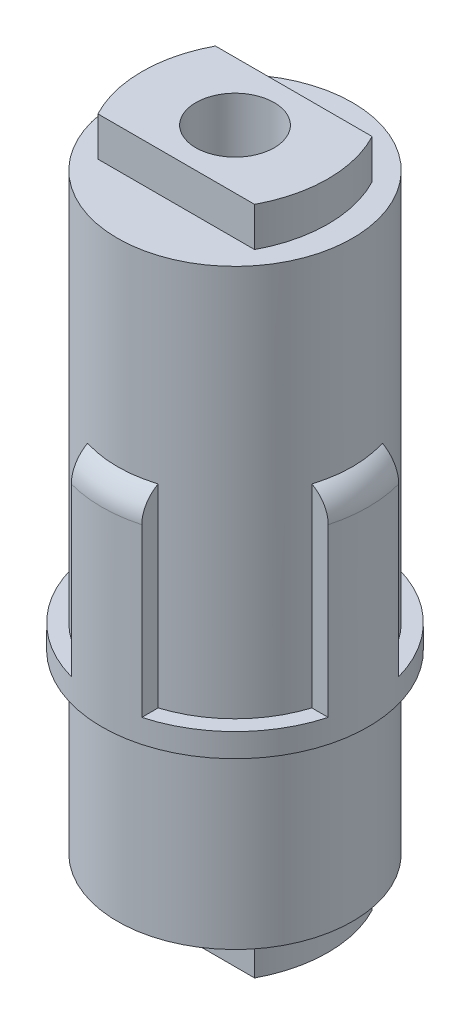
ISO-10303-21;
HEADER;
FILE_DESCRIPTION(('STEP AP214'),'2;1');
FILE_NAME('part.step','',(''),(''),'','','');
FILE_SCHEMA(('AUTOMOTIVE_DESIGN { 1 0 10303 214 1 1 1 1 }'));
ENDSEC;
DATA;
#1=APPLICATION_CONTEXT('core data for automotive mechanical design processes');
#2=APPLICATION_PROTOCOL_DEFINITION('international standard','automotive_design',2000,#1);
#3=PRODUCT_CONTEXT('',#1,'mechanical');
#4=PRODUCT('Part','Part','',(#3));
#5=PRODUCT_RELATED_PRODUCT_CATEGORY('part','',(#4));
#6=PRODUCT_DEFINITION_FORMATION('','',#4);
#7=PRODUCT_DEFINITION_CONTEXT('part definition',#1,'design');
#8=PRODUCT_DEFINITION('design','',#6,#7);
#9=PRODUCT_DEFINITION_SHAPE('','',#8);
#10=(LENGTH_UNIT() NAMED_UNIT(*) SI_UNIT(.MILLI.,.METRE.));
#11=(NAMED_UNIT(*) PLANE_ANGLE_UNIT() SI_UNIT($,.RADIAN.));
#12=(NAMED_UNIT(*) SI_UNIT($,.STERADIAN.) SOLID_ANGLE_UNIT());
#13=UNCERTAINTY_MEASURE_WITH_UNIT(LENGTH_MEASURE(1.E-05),#10,'distance_accuracy_value','');
#14=(GEOMETRIC_REPRESENTATION_CONTEXT(3) GLOBAL_UNCERTAINTY_ASSIGNED_CONTEXT((#13)) GLOBAL_UNIT_ASSIGNED_CONTEXT((#10,
#11,#12)) REPRESENTATION_CONTEXT('',''));
#15=CARTESIAN_POINT('',(0.,0.,0.));
#16=DIRECTION('',(0.,0.,1.));
#17=DIRECTION('',(1.,0.,0.));
#18=AXIS2_PLACEMENT_3D('',#15,#16,#17);
#19=CARTESIAN_POINT('',(0.,0.,0.));
#20=DIRECTION('',(0.,-1.,0.));
#21=DIRECTION('',(0.,0.,-1.));
#22=AXIS2_PLACEMENT_3D('',#19,#20,#21);
#23=PLANE('',#22);
#24=CARTESIAN_POINT('',(0.,0.,0.));
#25=DIRECTION('',(0.,1.,0.));
#26=DIRECTION('',(0.,0.,1.));
#27=AXIS2_PLACEMENT_3D('',#24,#25,#26);
#28=CIRCLE('',#27,7.5);
#29=CARTESIAN_POINT('',(-2.25,0.,-7.15454401062709));
#30=VERTEX_POINT('',#29);
#31=CARTESIAN_POINT('',(-7.15454401062709,0.,-2.25));
#32=VERTEX_POINT('',#31);
#33=EDGE_CURVE('E511',#30,#32,#28,.T.);
#34=ORIENTED_EDGE('',*,*,#33,.F.);
#35=DIRECTION('',(0.,0.,1.));
#36=VECTOR('',#35,1.);
#37=CARTESIAN_POINT('',(-2.25,0.,-8.1967981553775));
#38=LINE('',#37,#36);
#39=CARTESIAN_POINT('',(-2.25,0.,-8.1967981553775));
#40=VERTEX_POINT('',#39);
#41=EDGE_CURVE('E389',#40,#30,#38,.T.);
#42=ORIENTED_EDGE('',*,*,#41,.F.);
#43=CARTESIAN_POINT('',(0.,0.,0.));
#44=DIRECTION('',(0.,-1.,0.));
#45=DIRECTION('',(0.,0.,-1.));
#46=AXIS2_PLACEMENT_3D('',#43,#44,#45);
#47=CIRCLE('',#46,8.5);
#48=CARTESIAN_POINT('',(-8.1967981553775,0.,-2.25));
#49=VERTEX_POINT('',#48);
#50=EDGE_CURVE('E403',#49,#40,#47,.T.);
#51=ORIENTED_EDGE('',*,*,#50,.F.);
#52=DIRECTION('',(-1.,0.,0.));
#53=VECTOR('',#52,1.);
#54=CARTESIAN_POINT('',(-6.89202437604511,0.,-2.25));
#55=LINE('',#54,#53);
#56=EDGE_CURVE('E344',#32,#49,#55,.T.);
#57=ORIENTED_EDGE('',*,*,#56,.F.);
#58=EDGE_LOOP('',(#34,#42,#51,#57));
#59=FACE_BOUND('',#58,.T.);
#60=ADVANCED_FACE('F56',(#59),#23,.F.);
#61=CARTESIAN_POINT('',(-7.15454401062709,0.,2.25));
#62=VERTEX_POINT('',#61);
#63=CARTESIAN_POINT('',(-2.25,0.,7.15454401062709));
#64=VERTEX_POINT('',#63);
#65=EDGE_CURVE('E294',#62,#64,#28,.T.);
#66=ORIENTED_EDGE('',*,*,#65,.F.);
#67=DIRECTION('',(1.,0.,0.));
#68=VECTOR('',#67,1.);
#69=CARTESIAN_POINT('',(-6.89202437604511,0.,2.25));
#70=LINE('',#69,#68);
#71=CARTESIAN_POINT('',(-8.1967981553775,0.,2.25));
#72=VERTEX_POINT('',#71);
#73=EDGE_CURVE('E350',#72,#62,#70,.T.);
#74=ORIENTED_EDGE('',*,*,#73,.F.);
#75=CARTESIAN_POINT('',(-2.25,0.,8.1967981553775));
#76=VERTEX_POINT('',#75);
#77=EDGE_CURVE('E524',#76,#72,#47,.T.);
#78=ORIENTED_EDGE('',*,*,#77,.F.);
#79=DIRECTION('',(0.,0.,1.));
#80=VECTOR('',#79,1.);
#81=CARTESIAN_POINT('',(-2.25,0.,8.1967981553775));
#82=LINE('',#81,#80);
#83=EDGE_CURVE('E365',#64,#76,#82,.T.);
#84=ORIENTED_EDGE('',*,*,#83,.F.);
#85=EDGE_LOOP('',(#66,#74,#78,#84));
#86=FACE_BOUND('',#85,.T.);
#87=ADVANCED_FACE('F489',(#86),#23,.F.);
#88=CARTESIAN_POINT('',(2.25,0.,7.15454401062709));
#89=VERTEX_POINT('',#88);
#90=CARTESIAN_POINT('',(7.15454401062709,0.,2.25));
#91=VERTEX_POINT('',#90);
#92=EDGE_CURVE('E300',#89,#91,#28,.T.);
#93=ORIENTED_EDGE('',*,*,#92,.F.);
#94=DIRECTION('',(0.,0.,-1.));
#95=VECTOR('',#94,1.);
#96=CARTESIAN_POINT('',(2.25,0.,8.1967981553775));
#97=LINE('',#96,#95);
#98=CARTESIAN_POINT('',(2.25,0.,8.1967981553775));
#99=VERTEX_POINT('',#98);
#100=EDGE_CURVE('E361',#99,#89,#97,.T.);
#101=ORIENTED_EDGE('',*,*,#100,.F.);
#102=CARTESIAN_POINT('',(8.1967981553775,0.,2.25));
#103=VERTEX_POINT('',#102);
#104=EDGE_CURVE('E413',#103,#99,#47,.T.);
#105=ORIENTED_EDGE('',*,*,#104,.F.);
#106=DIRECTION('',(1.,0.,0.));
#107=VECTOR('',#106,1.);
#108=CARTESIAN_POINT('',(6.89202437604511,0.,2.25));
#109=LINE('',#108,#107);
#110=EDGE_CURVE('E375',#91,#103,#109,.T.);
#111=ORIENTED_EDGE('',*,*,#110,.F.);
#112=EDGE_LOOP('',(#93,#101,#105,#111));
#113=FACE_BOUND('',#112,.T.);
#114=ADVANCED_FACE('F539',(#113),#23,.F.);
#115=CARTESIAN_POINT('',(7.15454401062709,0.,-2.25));
#116=VERTEX_POINT('',#115);
#117=CARTESIAN_POINT('',(2.25,0.,-7.15454401062709));
#118=VERTEX_POINT('',#117);
#119=EDGE_CURVE('E303',#116,#118,#28,.T.);
#120=ORIENTED_EDGE('',*,*,#119,.F.);
#121=DIRECTION('',(-1.,0.,0.));
#122=VECTOR('',#121,1.);
#123=CARTESIAN_POINT('',(6.89202437604511,0.,-2.25));
#124=LINE('',#123,#122);
#125=CARTESIAN_POINT('',(8.19679815537751,0.,-2.25));
#126=VERTEX_POINT('',#125);
#127=EDGE_CURVE('E378',#126,#116,#124,.T.);
#128=ORIENTED_EDGE('',*,*,#127,.F.);
#129=CARTESIAN_POINT('',(2.25,0.,-8.1967981553775));
#130=VERTEX_POINT('',#129);
#131=EDGE_CURVE('E409',#130,#126,#47,.T.);
#132=ORIENTED_EDGE('',*,*,#131,.F.);
#133=DIRECTION('',(0.,0.,-1.));
#134=VECTOR('',#133,1.);
#135=CARTESIAN_POINT('',(2.25,0.,-8.1967981553775));
#136=LINE('',#135,#134);
#137=EDGE_CURVE('E393',#118,#130,#136,.T.);
#138=ORIENTED_EDGE('',*,*,#137,.F.);
#139=EDGE_LOOP('',(#120,#128,#132,#138));
#140=FACE_BOUND('',#139,.T.);
#141=ADVANCED_FACE('F478',(#140),#23,.F.);
#142=CARTESIAN_POINT('',(-2.25,12.5,-8.1967981553775));
#143=DIRECTION('',(1.,0.,0.));
#144=DIRECTION('',(0.,0.,-1.));
#145=AXIS2_PLACEMENT_3D('',#142,#143,#144);
#146=PLANE('',#145);
#147=DIRECTION('',(0.,-1.,0.));
#148=VECTOR('',#147,1.);
#149=CARTESIAN_POINT('',(-2.25,46.2132034355964,-7.15454401062709));
#150=LINE('',#149,#148);
#151=CARTESIAN_POINT('',(-2.25,12.378001185795,-7.15454401062709));
#152=VERTEX_POINT('',#151);
#153=EDGE_CURVE('E326',#152,#30,#150,.T.);
#154=ORIENTED_EDGE('',*,*,#153,.F.);
#155=CARTESIAN_POINT('',(-2.25,12.5,-6.89202437604511));
#156=CARTESIAN_POINT('',(-2.25,12.4791061311628,-6.94635625669846));
#157=CARTESIAN_POINT('',(-2.25,12.4560116676686,-6.99981697123115));
#158=CARTESIAN_POINT('',(-2.25,12.4055046719596,-7.10466973408814));
#159=CARTESIAN_POINT('',(-2.25,12.378091315717,-7.15606138528908));
#160=CARTESIAN_POINT('',(-2.25,12.2895078386146,-7.30661751819547));
#161=CARTESIAN_POINT('',(-2.25,12.2219964937387,-7.40215747638858));
#162=CARTESIAN_POINT('',(-2.25,12.0716064925068,-7.58046919260013));
#163=CARTESIAN_POINT('',(-2.25,11.9887042709286,-7.66322100958712));
#164=CARTESIAN_POINT('',(-2.25,11.8097967927969,-7.81302642080061));
#165=CARTESIAN_POINT('',(-2.25,11.7138002298588,-7.88009035101607));
#166=CARTESIAN_POINT('',(-2.25,11.5146930106107,-7.99436140488065));
#167=CARTESIAN_POINT('',(-2.25,11.4119040266993,-8.04213023044214));
#168=CARTESIAN_POINT('',(-2.25,11.1996187287232,-8.1191212713278));
#169=CARTESIAN_POINT('',(-2.25,11.0901282147757,-8.14835928281573));
#170=CARTESIAN_POINT('',(-2.25,10.9240165273401,-8.17747277452936));
#171=CARTESIAN_POINT('',(-2.25,10.8685967677682,-8.18471996991647));
#172=CARTESIAN_POINT('',(-2.25,10.7574438963181,-8.19437813078189));
#173=CARTESIAN_POINT('',(-2.25,10.7017115830306,-8.19679828788171));
#174=CARTESIAN_POINT('',(-2.25,10.6459503782261,-8.1967981553775));
#175=B_SPLINE_CURVE_WITH_KNOTS('',3,(#155,#156,#157,#158,#159,#160,#161,#162,#163,#164,#165,
#166,#167,#168,#169,#170,#171,#172,#173,#174),.UNSPECIFIED.,.F.,.F.,(4,2,2,2,2,2,2,2,2,4),(0.,
0.174535420831491,0.349104182759231,0.698259802026039,1.04795449536431,1.39741813877047,
1.73581200221471,2.07391702029522,2.24141024833911,2.40858423097572),.UNSPECIFIED.);
#176=CARTESIAN_POINT('',(-2.25,10.6459503782261,-8.1967981553775));
#177=VERTEX_POINT('',#176);
#178=EDGE_CURVE('E454',#152,#177,#175,.T.);
#179=ORIENTED_EDGE('',*,*,#178,.T.);
#180=DIRECTION('',(0.,-1.,0.));
#181=VECTOR('',#180,1.);
#182=CARTESIAN_POINT('',(-2.25,12.5,-8.1967981553775));
#183=LINE('',#182,#181);
#184=EDGE_CURVE('E400',#177,#40,#183,.T.);
#185=ORIENTED_EDGE('',*,*,#184,.T.);
#186=ORIENTED_EDGE('',*,*,#41,.T.);
#187=EDGE_LOOP('',(#154,#179,#185,#186));
#188=FACE_BOUND('',#187,.T.);
#189=ADVANCED_FACE('F473',(#188),#146,.F.);
#190=CARTESIAN_POINT('',(2.25,12.5,-8.1967981553775));
#191=DIRECTION('',(-1.,0.,0.));
#192=DIRECTION('',(0.,0.,1.));
#193=AXIS2_PLACEMENT_3D('',#190,#191,#192);
#194=PLANE('',#193);
#195=DIRECTION('',(0.,-1.,0.));
#196=VECTOR('',#195,1.);
#197=CARTESIAN_POINT('',(2.25,46.2132034355964,-7.15454401062709));
#198=LINE('',#197,#196);
#199=CARTESIAN_POINT('',(2.25,12.378001185795,-7.15454401062709));
#200=VERTEX_POINT('',#199);
#201=EDGE_CURVE('E323',#118,#200,#198,.F.);
#202=ORIENTED_EDGE('',*,*,#201,.F.);
#203=ORIENTED_EDGE('',*,*,#137,.T.);
#204=DIRECTION('',(0.,-1.,0.));
#205=VECTOR('',#204,1.);
#206=CARTESIAN_POINT('',(2.25,12.5,-8.1967981553775));
#207=LINE('',#206,#205);
#208=CARTESIAN_POINT('',(2.25,10.6459503782261,-8.1967981553775));
#209=VERTEX_POINT('',#208);
#210=EDGE_CURVE('E396',#209,#130,#207,.T.);
#211=ORIENTED_EDGE('',*,*,#210,.F.);
#212=CARTESIAN_POINT('',(2.25,10.6459503782261,-8.1967981553775));
#213=CARTESIAN_POINT('',(2.25,10.7006536063435,-8.19679856122423));
#214=CARTESIAN_POINT('',(2.25,10.7553301992734,-8.19446926154066));
#215=CARTESIAN_POINT('',(2.25,10.8642832301839,-8.1851821706423));
#216=CARTESIAN_POINT('',(2.25,10.9185597087332,-8.17822485538833));
#217=CARTESIAN_POINT('',(2.25,11.0800371465478,-8.1504992044397));
#218=CARTESIAN_POINT('',(2.25,11.1861414070615,-8.1228768337697));
#219=CARTESIAN_POINT('',(2.25,11.3921712487835,-8.0502522346582));
#220=CARTESIAN_POINT('',(2.25,11.4920958817738,-8.0052473466363));
#221=CARTESIAN_POINT('',(2.25,11.6831067804059,-7.89930283859968));
#222=CARTESIAN_POINT('',(2.25,11.7741931766309,-7.83836345406293));
#223=CARTESIAN_POINT('',(2.25,11.9462773845051,-7.7015764408393));
#224=CARTESIAN_POINT('',(2.25,12.027130585048,-7.62554737626708));
#225=CARTESIAN_POINT('',(2.25,12.1754365985885,-7.46136227656485));
#226=CARTESIAN_POINT('',(2.25,12.2428889394331,-7.37320581433484));
#227=CARTESIAN_POINT('',(2.25,12.3423883821849,-7.21915879648026));
#228=CARTESIAN_POINT('',(2.25,12.3786597640515,-7.15594602711386));
#229=CARTESIAN_POINT('',(2.25,12.4444265038275,-7.02627301460051));
#230=CARTESIAN_POINT('',(2.25,12.473937533967,-6.95982072468452));
#231=CARTESIAN_POINT('',(2.25,12.5,-6.89202437604511));
#232=B_SPLINE_CURVE_WITH_KNOTS('',3,(#212,#213,#214,#215,#216,#217,#218,#219,#220,#221,#222,
#223,#224,#225,#226,#227,#228,#229,#230,#231),.UNSPECIFIED.,.F.,.F.,(4,2,2,2,2,2,2,2,2,4),(0.,
0.164007424153622,0.327997983834462,0.655223090964984,0.982498284422449,1.30976864172152,
1.64124264262274,1.97272832029121,2.19100649909829,2.40877341327221),.UNSPECIFIED.);
#233=EDGE_CURVE('E464',#209,#200,#232,.T.);
#234=ORIENTED_EDGE('',*,*,#233,.T.);
#235=EDGE_LOOP('',(#202,#203,#211,#234));
#236=FACE_BOUND('',#235,.T.);
#237=ADVANCED_FACE('F477',(#236),#194,.F.);
#238=CARTESIAN_POINT('',(6.89202437604511,12.5,2.25));
#239=DIRECTION('',(0.,0.,-1.));
#240=DIRECTION('',(-1.,0.,0.));
#241=AXIS2_PLACEMENT_3D('',#238,#239,#240);
#242=PLANE('',#241);
#243=DIRECTION('',(0.,-1.,0.));
#244=VECTOR('',#243,1.);
#245=CARTESIAN_POINT('',(7.15454401062709,46.2132034355964,2.25));
#246=LINE('',#245,#244);
#247=CARTESIAN_POINT('',(7.15454401062709,12.378001185795,2.25));
#248=VERTEX_POINT('',#247);
#249=EDGE_CURVE('E316',#91,#248,#246,.F.);
#250=ORIENTED_EDGE('',*,*,#249,.F.);
#251=ORIENTED_EDGE('',*,*,#110,.T.);
#252=DIRECTION('',(0.,-1.,0.));
#253=VECTOR('',#252,1.);
#254=CARTESIAN_POINT('',(8.1967981553775,12.5,2.25));
#255=LINE('',#254,#253);
#256=CARTESIAN_POINT('',(8.1967981553775,10.6459503782261,2.25));
#257=VERTEX_POINT('',#256);
#258=EDGE_CURVE('E385',#257,#103,#255,.T.);
#259=ORIENTED_EDGE('',*,*,#258,.F.);
#260=CARTESIAN_POINT('',(8.1967981553775,10.6459503782261,2.25));
#261=CARTESIAN_POINT('',(8.19679856122423,10.7006536063435,2.25));
#262=CARTESIAN_POINT('',(8.19446926154066,10.7553301992734,2.25));
#263=CARTESIAN_POINT('',(8.1851821706423,10.8642832301839,2.25));
#264=CARTESIAN_POINT('',(8.17822485538833,10.9185597087332,2.25));
#265=CARTESIAN_POINT('',(8.1504992044397,11.0800371465478,2.25));
#266=CARTESIAN_POINT('',(8.1228768337697,11.1861414070615,2.25));
#267=CARTESIAN_POINT('',(8.0502522346582,11.3921712487835,2.25));
#268=CARTESIAN_POINT('',(8.00524734663631,11.4920958817738,2.25));
#269=CARTESIAN_POINT('',(7.89930283859968,11.6831067804059,2.25));
#270=CARTESIAN_POINT('',(7.83836345406293,11.7741931766309,2.25));
#271=CARTESIAN_POINT('',(7.7015764408393,11.9462773845051,2.25));
#272=CARTESIAN_POINT('',(7.62554737626708,12.027130585048,2.25));
#273=CARTESIAN_POINT('',(7.46136227656485,12.1754365985885,2.25));
#274=CARTESIAN_POINT('',(7.37320581433484,12.2428889394331,2.25));
#275=CARTESIAN_POINT('',(7.21915879648026,12.3423883821849,2.25));
#276=CARTESIAN_POINT('',(7.15594602711386,12.3786597640515,2.25));
#277=CARTESIAN_POINT('',(7.02627301460051,12.4444265038275,2.25));
#278=CARTESIAN_POINT('',(6.95982072468452,12.473937533967,2.25));
#279=CARTESIAN_POINT('',(6.89202437604511,12.5,2.25));
#280=B_SPLINE_CURVE_WITH_KNOTS('',3,(#260,#261,#262,#263,#264,#265,#266,#267,#268,#269,#270,
#271,#272,#273,#274,#275,#276,#277,#278,#279),.UNSPECIFIED.,.F.,.F.,(4,2,2,2,2,2,2,2,2,4),(0.,
0.164007424153622,0.327997983834462,0.655223090964984,0.982498284422448,1.30976864172152,
1.64124264262274,1.97272832029121,2.19100649909829,2.40877341327221),.UNSPECIFIED.);
#281=EDGE_CURVE('E547',#257,#248,#280,.T.);
#282=ORIENTED_EDGE('',*,*,#281,.T.);
#283=EDGE_LOOP('',(#250,#251,#259,#282));
#284=FACE_BOUND('',#283,.T.);
#285=ADVANCED_FACE('F574',(#284),#242,.F.);
#286=CARTESIAN_POINT('',(6.89202437604511,12.5,-2.25));
#287=DIRECTION('',(0.,0.,1.));
#288=DIRECTION('',(1.,0.,0.));
#289=AXIS2_PLACEMENT_3D('',#286,#287,#288);
#290=PLANE('',#289);
#291=DIRECTION('',(0.,-1.,0.));
#292=VECTOR('',#291,1.);
#293=CARTESIAN_POINT('',(7.15454401062709,46.2132034355964,-2.25));
#294=LINE('',#293,#292);
#295=CARTESIAN_POINT('',(7.15454401062709,12.378001185795,-2.25));
#296=VERTEX_POINT('',#295);
#297=EDGE_CURVE('E313',#296,#116,#294,.T.);
#298=ORIENTED_EDGE('',*,*,#297,.F.);
#299=CARTESIAN_POINT('',(6.89202437604511,12.5,-2.25));
#300=CARTESIAN_POINT('',(6.94635625669846,12.4791061311628,-2.25));
#301=CARTESIAN_POINT('',(6.99981697123115,12.4560116676686,-2.25));
#302=CARTESIAN_POINT('',(7.10466973408815,12.4055046719596,-2.25));
#303=CARTESIAN_POINT('',(7.15606138528909,12.378091315717,-2.25));
#304=CARTESIAN_POINT('',(7.30661751819547,12.2895078386146,-2.25));
#305=CARTESIAN_POINT('',(7.40215747638859,12.2219964937387,-2.25));
#306=CARTESIAN_POINT('',(7.58046919260014,12.0716064925068,-2.25));
#307=CARTESIAN_POINT('',(7.66322100958712,11.9887042709286,-2.25));
#308=CARTESIAN_POINT('',(7.81302642080061,11.8097967927969,-2.25));
#309=CARTESIAN_POINT('',(7.88009035101607,11.7138002298587,-2.25));
#310=CARTESIAN_POINT('',(7.99436140488065,11.5146930106107,-2.25));
#311=CARTESIAN_POINT('',(8.04213023044214,11.4119040266993,-2.25));
#312=CARTESIAN_POINT('',(8.1191212713278,11.1996187287232,-2.25));
#313=CARTESIAN_POINT('',(8.14835928281573,11.0901282147757,-2.25));
#314=CARTESIAN_POINT('',(8.17747277452937,10.9240165273401,-2.25));
#315=CARTESIAN_POINT('',(8.18471996991647,10.8685967677682,-2.25));
#316=CARTESIAN_POINT('',(8.19437813078189,10.7574438963181,-2.25));
#317=CARTESIAN_POINT('',(8.19679828788171,10.7017115830306,-2.25));
#318=CARTESIAN_POINT('',(8.1967981553775,10.6459503782261,-2.25));
#319=B_SPLINE_CURVE_WITH_KNOTS('',3,(#299,#300,#301,#302,#303,#304,#305,#306,#307,#308,#309,
#310,#311,#312,#313,#314,#315,#316,#317,#318),.UNSPECIFIED.,.F.,.F.,(4,2,2,2,2,2,2,2,2,4),(0.,
0.174535420831492,0.349104182759231,0.69825980202604,1.04795449536431,1.39741813877047,
1.73581200221471,2.07391702029523,2.24141024833911,2.40858423097572),.UNSPECIFIED.);
#320=CARTESIAN_POINT('',(8.19679815537751,10.6459503782261,-2.25));
#321=VERTEX_POINT('',#320);
#322=EDGE_CURVE('E554',#296,#321,#319,.T.);
#323=ORIENTED_EDGE('',*,*,#322,.T.);
#324=DIRECTION('',(0.,-1.,0.));
#325=VECTOR('',#324,1.);
#326=CARTESIAN_POINT('',(8.19679815537751,12.5,-2.25));
#327=LINE('',#326,#325);
#328=EDGE_CURVE('E382',#321,#126,#327,.T.);
#329=ORIENTED_EDGE('',*,*,#328,.T.);
#330=ORIENTED_EDGE('',*,*,#127,.T.);
#331=EDGE_LOOP('',(#298,#323,#329,#330));
#332=FACE_BOUND('',#331,.T.);
#333=ADVANCED_FACE('F571',(#332),#290,.F.);
#334=CARTESIAN_POINT('',(2.25,12.5,8.1967981553775));
#335=DIRECTION('',(-1.,0.,0.));
#336=DIRECTION('',(0.,0.,1.));
#337=AXIS2_PLACEMENT_3D('',#334,#335,#336);
#338=PLANE('',#337);
#339=DIRECTION('',(0.,-1.,0.));
#340=VECTOR('',#339,1.);
#341=CARTESIAN_POINT('',(2.25,46.2132034355964,7.15454401062709));
#342=LINE('',#341,#340);
#343=CARTESIAN_POINT('',(2.25,12.378001185795,7.15454401062709));
#344=VERTEX_POINT('',#343);
#345=EDGE_CURVE('E306',#344,#89,#342,.T.);
#346=ORIENTED_EDGE('',*,*,#345,.F.);
#347=CARTESIAN_POINT('',(2.25,12.5,6.89202437604511));
#348=CARTESIAN_POINT('',(2.25,12.4791061311628,6.94635625669846));
#349=CARTESIAN_POINT('',(2.25,12.4560116676686,6.99981697123115));
#350=CARTESIAN_POINT('',(2.25,12.4055046719596,7.10466973408815));
#351=CARTESIAN_POINT('',(2.25,12.378091315717,7.15606138528908));
#352=CARTESIAN_POINT('',(2.25,12.2895078386146,7.30661751819547));
#353=CARTESIAN_POINT('',(2.25,12.2219964937387,7.40215747638858));
#354=CARTESIAN_POINT('',(2.25,12.0716064925068,7.58046919260014));
#355=CARTESIAN_POINT('',(2.25,11.9887042709286,7.66322100958712));
#356=CARTESIAN_POINT('',(2.25,11.8097967927969,7.81302642080061));
#357=CARTESIAN_POINT('',(2.25,11.7138002298588,7.88009035101607));
#358=CARTESIAN_POINT('',(2.25,11.5146930106107,7.99436140488065));
#359=CARTESIAN_POINT('',(2.25,11.4119040266993,8.04213023044214));
#360=CARTESIAN_POINT('',(2.25,11.1996187287232,8.1191212713278));
#361=CARTESIAN_POINT('',(2.25,11.0901282147757,8.14835928281573));
#362=CARTESIAN_POINT('',(2.25,10.9240165273401,8.17747277452936));
#363=CARTESIAN_POINT('',(2.25,10.8685967677682,8.18471996991647));
#364=CARTESIAN_POINT('',(2.25,10.7574438963181,8.19437813078189));
#365=CARTESIAN_POINT('',(2.25,10.7017115830306,8.19679828788171));
#366=CARTESIAN_POINT('',(2.25,10.6459503782261,8.1967981553775));
#367=B_SPLINE_CURVE_WITH_KNOTS('',3,(#347,#348,#349,#350,#351,#352,#353,#354,#355,#356,#357,
#358,#359,#360,#361,#362,#363,#364,#365,#366),.UNSPECIFIED.,.F.,.F.,(4,2,2,2,2,2,2,2,2,4),(0.,
0.174535420831491,0.349104182759231,0.698259802026038,1.04795449536431,1.39741813877047,
1.73581200221471,2.07391702029522,2.24141024833911,2.40858423097572),.UNSPECIFIED.);
#368=CARTESIAN_POINT('',(2.25,10.6459503782261,8.1967981553775));
#369=VERTEX_POINT('',#368);
#370=EDGE_CURVE('E544',#344,#369,#367,.T.);
#371=ORIENTED_EDGE('',*,*,#370,.T.);
#372=DIRECTION('',(0.,-1.,0.));
#373=VECTOR('',#372,1.);
#374=CARTESIAN_POINT('',(2.25,12.5,8.1967981553775));
#375=LINE('',#374,#373);
#376=EDGE_CURVE('E372',#369,#99,#375,.T.);
#377=ORIENTED_EDGE('',*,*,#376,.T.);
#378=ORIENTED_EDGE('',*,*,#100,.T.);
#379=EDGE_LOOP('',(#346,#371,#377,#378));
#380=FACE_BOUND('',#379,.T.);
#381=ADVANCED_FACE('F542',(#380),#338,.F.);
#382=CARTESIAN_POINT('',(-2.25,12.5,8.1967981553775));
#383=DIRECTION('',(1.,0.,0.));
#384=DIRECTION('',(0.,0.,-1.));
#385=AXIS2_PLACEMENT_3D('',#382,#383,#384);
#386=PLANE('',#385);
#387=DIRECTION('',(0.,-1.,0.));
#388=VECTOR('',#387,1.);
#389=CARTESIAN_POINT('',(-2.25,46.2132034355964,7.15454401062709));
#390=LINE('',#389,#388);
#391=CARTESIAN_POINT('',(-2.25,12.378001185795,7.15454401062712));
#392=VERTEX_POINT('',#391);
#393=EDGE_CURVE('E299',#64,#392,#390,.F.);
#394=ORIENTED_EDGE('',*,*,#393,.F.);
#395=ORIENTED_EDGE('',*,*,#83,.T.);
#396=DIRECTION('',(0.,-1.,0.));
#397=VECTOR('',#396,1.);
#398=CARTESIAN_POINT('',(-2.25,12.5,8.1967981553775));
#399=LINE('',#398,#397);
#400=CARTESIAN_POINT('',(-2.25,10.6459503782261,8.1967981553775));
#401=VERTEX_POINT('',#400);
#402=EDGE_CURVE('E368',#401,#76,#399,.T.);
#403=ORIENTED_EDGE('',*,*,#402,.F.);
#404=CARTESIAN_POINT('',(-2.25,10.6459503782261,8.1967981553775));
#405=CARTESIAN_POINT('',(-2.25,10.7006536063435,8.19679856122423));
#406=CARTESIAN_POINT('',(-2.25,10.7553301992734,8.19446926154066));
#407=CARTESIAN_POINT('',(-2.25,10.8642832301839,8.1851821706423));
#408=CARTESIAN_POINT('',(-2.25,10.9185597087332,8.17822485538833));
#409=CARTESIAN_POINT('',(-2.25,11.0800371465478,8.1504992044397));
#410=CARTESIAN_POINT('',(-2.25,11.1861414070615,8.12287683376971));
#411=CARTESIAN_POINT('',(-2.25,11.3921712487835,8.0502522346582));
#412=CARTESIAN_POINT('',(-2.25,11.4920958817738,8.0052473466363));
#413=CARTESIAN_POINT('',(-2.25,11.6831067804059,7.89930283859968));
#414=CARTESIAN_POINT('',(-2.25,11.7741931766309,7.83836345406293));
#415=CARTESIAN_POINT('',(-2.25,11.9462773845051,7.7015764408393));
#416=CARTESIAN_POINT('',(-2.25,12.027130585048,7.62554737626709));
#417=CARTESIAN_POINT('',(-2.25,12.1754365985885,7.46136227656485));
#418=CARTESIAN_POINT('',(-2.25,12.2428889394331,7.37320581433484));
#419=CARTESIAN_POINT('',(-2.25,12.3423883821849,7.21915879648026));
#420=CARTESIAN_POINT('',(-2.25,12.3786597640515,7.15594602711386));
#421=CARTESIAN_POINT('',(-2.25,12.4444265038275,7.02627301460051));
#422=CARTESIAN_POINT('',(-2.25,12.473937533967,6.95982072468452));
#423=CARTESIAN_POINT('',(-2.25,12.5,6.89202437604511));
#424=B_SPLINE_CURVE_WITH_KNOTS('',3,(#404,#405,#406,#407,#408,#409,#410,#411,#412,#413,#414,
#415,#416,#417,#418,#419,#420,#421,#422,#423),.UNSPECIFIED.,.F.,.F.,(4,2,2,2,2,2,2,2,2,4),(0.,
0.164007424153622,0.327997983834463,0.655223090964984,0.982498284422453,1.30976864172152,
1.64124264262273,1.9727283202912,2.19100649909829,2.40877341327221),.UNSPECIFIED.);
#425=EDGE_CURVE('E67',#401,#392,#424,.T.);
#426=ORIENTED_EDGE('',*,*,#425,.T.);
#427=EDGE_LOOP('',(#394,#395,#403,#426));
#428=FACE_BOUND('',#427,.T.);
#429=ADVANCED_FACE('F440',(#428),#386,.F.);
#430=CARTESIAN_POINT('',(-6.89202437604511,12.5,-2.25));
#431=DIRECTION('',(0.,0.,1.));
#432=DIRECTION('',(1.,0.,0.));
#433=AXIS2_PLACEMENT_3D('',#430,#431,#432);
#434=PLANE('',#433);
#435=DIRECTION('',(0.,-1.,0.));
#436=VECTOR('',#435,1.);
#437=CARTESIAN_POINT('',(-7.15454401062709,46.2132034355964,-2.25));
#438=LINE('',#437,#436);
#439=CARTESIAN_POINT('',(-7.15454401062709,12.378001185795,-2.25));
#440=VERTEX_POINT('',#439);
#441=EDGE_CURVE('E336',#32,#440,#438,.F.);
#442=ORIENTED_EDGE('',*,*,#441,.F.);
#443=ORIENTED_EDGE('',*,*,#56,.T.);
#444=DIRECTION('',(0.,-1.,0.));
#445=VECTOR('',#444,1.);
#446=CARTESIAN_POINT('',(-8.1967981553775,12.5,-2.25));
#447=LINE('',#446,#445);
#448=CARTESIAN_POINT('',(-8.1967981553775,10.6459503782261,-2.25));
#449=VERTEX_POINT('',#448);
#450=EDGE_CURVE('E357',#449,#49,#447,.T.);
#451=ORIENTED_EDGE('',*,*,#450,.F.);
#452=CARTESIAN_POINT('',(-8.1967981553775,10.6459503782261,-2.25));
#453=CARTESIAN_POINT('',(-8.19679856122422,10.7006536063435,-2.25));
#454=CARTESIAN_POINT('',(-8.19446926154066,10.7553301992734,-2.25));
#455=CARTESIAN_POINT('',(-8.1851821706423,10.8642832301839,-2.25));
#456=CARTESIAN_POINT('',(-8.17822485538833,10.9185597087332,-2.25));
#457=CARTESIAN_POINT('',(-8.1504992044397,11.0800371465478,-2.25));
#458=CARTESIAN_POINT('',(-8.1228768337697,11.1861414070615,-2.25));
#459=CARTESIAN_POINT('',(-8.0502522346582,11.3921712487835,-2.25));
#460=CARTESIAN_POINT('',(-8.0052473466363,11.4920958817738,-2.25));
#461=CARTESIAN_POINT('',(-7.89930283859968,11.6831067804059,-2.25));
#462=CARTESIAN_POINT('',(-7.83836345406293,11.7741931766309,-2.25));
#463=CARTESIAN_POINT('',(-7.70157644083929,11.9462773845051,-2.25));
#464=CARTESIAN_POINT('',(-7.62554737626708,12.027130585048,-2.25));
#465=CARTESIAN_POINT('',(-7.46136227656485,12.1754365985885,-2.25));
#466=CARTESIAN_POINT('',(-7.37320581433484,12.2428889394331,-2.25));
#467=CARTESIAN_POINT('',(-7.21915879648026,12.3423883821849,-2.25));
#468=CARTESIAN_POINT('',(-7.15594602711386,12.3786597640515,-2.25));
#469=CARTESIAN_POINT('',(-7.02627301460051,12.4444265038275,-2.25));
#470=CARTESIAN_POINT('',(-6.95982072468452,12.473937533967,-2.25));
#471=CARTESIAN_POINT('',(-6.89202437604511,12.5,-2.25));
#472=B_SPLINE_CURVE_WITH_KNOTS('',3,(#452,#453,#454,#455,#456,#457,#458,#459,#460,#461,#462,
#463,#464,#465,#466,#467,#468,#469,#470,#471),.UNSPECIFIED.,.F.,.F.,(4,2,2,2,2,2,2,2,2,4),(0.,
0.164007424153622,0.327997983834463,0.655223090964984,0.982498284422452,1.30976864172152,
1.64124264262274,1.97272832029121,2.19100649909829,2.40877341327221),.UNSPECIFIED.);
#473=EDGE_CURVE('E445',#449,#440,#472,.T.);
#474=ORIENTED_EDGE('',*,*,#473,.T.);
#475=EDGE_LOOP('',(#442,#443,#451,#474));
#476=FACE_BOUND('',#475,.T.);
#477=ADVANCED_FACE('F433',(#476),#434,.F.);
#478=CARTESIAN_POINT('',(-6.89202437604511,12.5,2.25));
#479=DIRECTION('',(0.,0.,-1.));
#480=DIRECTION('',(-1.,0.,0.));
#481=AXIS2_PLACEMENT_3D('',#478,#479,#480);
#482=PLANE('',#481);
#483=DIRECTION('',(0.,-1.,0.));
#484=VECTOR('',#483,1.);
#485=CARTESIAN_POINT('',(-7.15454401062709,46.2132034355964,2.25));
#486=LINE('',#485,#484);
#487=CARTESIAN_POINT('',(-7.15454401062709,12.378001185795,2.25));
#488=VERTEX_POINT('',#487);
#489=EDGE_CURVE('E333',#488,#62,#486,.T.);
#490=ORIENTED_EDGE('',*,*,#489,.F.);
#491=CARTESIAN_POINT('',(-6.89202437604511,12.5,2.25));
#492=CARTESIAN_POINT('',(-6.94635625669846,12.4791061311628,2.25));
#493=CARTESIAN_POINT('',(-6.99981697123115,12.4560116676686,2.25));
#494=CARTESIAN_POINT('',(-7.10466973408814,12.4055046719596,2.25));
#495=CARTESIAN_POINT('',(-7.15606138528908,12.378091315717,2.25));
#496=CARTESIAN_POINT('',(-7.30661751819547,12.2895078386146,2.25));
#497=CARTESIAN_POINT('',(-7.40215747638858,12.2219964937387,2.25));
#498=CARTESIAN_POINT('',(-7.58046919260013,12.0716064925068,2.25));
#499=CARTESIAN_POINT('',(-7.66322100958712,11.9887042709286,2.25));
#500=CARTESIAN_POINT('',(-7.81302642080061,11.8097967927969,2.25));
#501=CARTESIAN_POINT('',(-7.88009035101607,11.7138002298588,2.25));
#502=CARTESIAN_POINT('',(-7.99436140488065,11.5146930106107,2.25));
#503=CARTESIAN_POINT('',(-8.04213023044214,11.4119040266993,2.25));
#504=CARTESIAN_POINT('',(-8.1191212713278,11.1996187287232,2.25));
#505=CARTESIAN_POINT('',(-8.14835928281573,11.0901282147757,2.25));
#506=CARTESIAN_POINT('',(-8.17747277452936,10.9240165273401,2.25));
#507=CARTESIAN_POINT('',(-8.18471996991647,10.8685967677682,2.25));
#508=CARTESIAN_POINT('',(-8.19437813078189,10.7574438963181,2.25));
#509=CARTESIAN_POINT('',(-8.19679828788171,10.7017115830306,2.25));
#510=CARTESIAN_POINT('',(-8.1967981553775,10.6459503782261,2.25));
#511=B_SPLINE_CURVE_WITH_KNOTS('',3,(#491,#492,#493,#494,#495,#496,#497,#498,#499,#500,#501,
#502,#503,#504,#505,#506,#507,#508,#509,#510),.UNSPECIFIED.,.F.,.F.,(4,2,2,2,2,2,2,2,2,4),(0.,
0.174535420831491,0.349104182759231,0.698259802026039,1.04795449536431,1.39741813877047,
1.73581200221471,2.07391702029523,2.24141024833911,2.40858423097572),.UNSPECIFIED.);
#512=CARTESIAN_POINT('',(-8.1967981553775,10.6459503782261,2.25));
#513=VERTEX_POINT('',#512);
#514=EDGE_CURVE('E408',#488,#513,#511,.T.);
#515=ORIENTED_EDGE('',*,*,#514,.T.);
#516=DIRECTION('',(0.,-1.,0.));
#517=VECTOR('',#516,1.);
#518=CARTESIAN_POINT('',(-8.1967981553775,12.5,2.25));
#519=LINE('',#518,#517);
#520=EDGE_CURVE('E354',#513,#72,#519,.T.);
#521=ORIENTED_EDGE('',*,*,#520,.T.);
#522=ORIENTED_EDGE('',*,*,#73,.T.);
#523=EDGE_LOOP('',(#490,#515,#521,#522));
#524=FACE_BOUND('',#523,.T.);
#525=ADVANCED_FACE('F428',(#524),#482,.F.);
#526=CARTESIAN_POINT('',(0.,10.6459503782261,0.));
#527=DIRECTION('',(0.,1.,0.));
#528=DIRECTION('',(0.,0.,1.));
#529=AXIS2_PLACEMENT_3D('',#526,#527,#528);
#530=TOROIDAL_SURFACE('',#529,6.5,2.);
#531=ORIENTED_EDGE('',*,*,#514,.F.);
#532=CARTESIAN_POINT('',(0.,12.378001185795,0.));
#533=DIRECTION('',(0.,-1.,0.));
#534=DIRECTION('',(0.,0.,-1.));
#535=AXIS2_PLACEMENT_3D('',#532,#533,#534);
#536=CIRCLE('',#535,7.5);
#537=EDGE_CURVE('E329',#488,#440,#536,.T.);
#538=ORIENTED_EDGE('',*,*,#537,.T.);
#539=ORIENTED_EDGE('',*,*,#473,.F.);
#540=CARTESIAN_POINT('',(0.,10.6459503782261,0.));
#541=DIRECTION('',(0.,1.,0.));
#542=DIRECTION('',(0.,0.,1.));
#543=AXIS2_PLACEMENT_3D('',#540,#541,#542);
#544=CIRCLE('',#543,8.5);
#545=EDGE_CURVE('E455',#513,#449,#544,.F.);
#546=ORIENTED_EDGE('',*,*,#545,.F.);
#547=EDGE_LOOP('',(#531,#538,#539,#546));
#548=FACE_BOUND('',#547,.T.);
#549=ADVANCED_FACE('F424',(#548),#530,.T.);
#550=CARTESIAN_POINT('',(0.,10.6459503782261,0.));
#551=DIRECTION('',(0.,1.,0.));
#552=DIRECTION('',(0.,0.,1.));
#553=AXIS2_PLACEMENT_3D('',#550,#551,#552);
#554=TOROIDAL_SURFACE('',#553,6.5,2.);
#555=ORIENTED_EDGE('',*,*,#178,.F.);
#556=CARTESIAN_POINT('',(0.,12.378001185795,0.));
#557=DIRECTION('',(0.,-1.,0.));
#558=DIRECTION('',(0.,0.,-1.));
#559=AXIS2_PLACEMENT_3D('',#556,#557,#558);
#560=CIRCLE('',#559,7.5);
#561=EDGE_CURVE('E319',#152,#200,#560,.T.);
#562=ORIENTED_EDGE('',*,*,#561,.T.);
#563=ORIENTED_EDGE('',*,*,#233,.F.);
#564=CARTESIAN_POINT('',(0.,10.6459503782261,0.));
#565=DIRECTION('',(0.,1.,0.));
#566=DIRECTION('',(0.,0.,1.));
#567=AXIS2_PLACEMENT_3D('',#564,#565,#566);
#568=CIRCLE('',#567,8.5);
#569=EDGE_CURVE('E620',#177,#209,#568,.F.);
#570=ORIENTED_EDGE('',*,*,#569,.F.);
#571=EDGE_LOOP('',(#555,#562,#563,#570));
#572=FACE_BOUND('',#571,.T.);
#573=ADVANCED_FACE('F471',(#572),#554,.T.);
#574=CARTESIAN_POINT('',(0.,10.6459503782261,0.));
#575=DIRECTION('',(0.,1.,0.));
#576=DIRECTION('',(0.,0.,1.));
#577=AXIS2_PLACEMENT_3D('',#574,#575,#576);
#578=TOROIDAL_SURFACE('',#577,6.5,2.);
#579=ORIENTED_EDGE('',*,*,#322,.F.);
#580=CARTESIAN_POINT('',(0.,12.378001185795,0.));
#581=DIRECTION('',(0.,-1.,0.));
#582=DIRECTION('',(0.,0.,-1.));
#583=AXIS2_PLACEMENT_3D('',#580,#581,#582);
#584=CIRCLE('',#583,7.5);
#585=EDGE_CURVE('E309',#296,#248,#584,.T.);
#586=ORIENTED_EDGE('',*,*,#585,.T.);
#587=ORIENTED_EDGE('',*,*,#281,.F.);
#588=CARTESIAN_POINT('',(0.,10.6459503782261,0.));
#589=DIRECTION('',(0.,1.,0.));
#590=DIRECTION('',(0.,0.,1.));
#591=AXIS2_PLACEMENT_3D('',#588,#589,#590);
#592=CIRCLE('',#591,8.5);
#593=EDGE_CURVE('E595',#321,#257,#592,.F.);
#594=ORIENTED_EDGE('',*,*,#593,.F.);
#595=EDGE_LOOP('',(#579,#586,#587,#594));
#596=FACE_BOUND('',#595,.T.);
#597=ADVANCED_FACE('F582',(#596),#578,.T.);
#598=CARTESIAN_POINT('',(0.,10.6459503782261,0.));
#599=DIRECTION('',(0.,1.,0.));
#600=DIRECTION('',(0.,0.,1.));
#601=AXIS2_PLACEMENT_3D('',#598,#599,#600);
#602=TOROIDAL_SURFACE('',#601,6.5,2.);
#603=ORIENTED_EDGE('',*,*,#370,.F.);
#604=CARTESIAN_POINT('',(0.,12.378001185795,0.));
#605=DIRECTION('',(0.,-1.,0.));
#606=DIRECTION('',(0.,0.,-1.));
#607=AXIS2_PLACEMENT_3D('',#604,#605,#606);
#608=CIRCLE('',#607,7.5);
#609=EDGE_CURVE('E12',#344,#392,#608,.T.);
#610=ORIENTED_EDGE('',*,*,#609,.T.);
#611=ORIENTED_EDGE('',*,*,#425,.F.);
#612=CARTESIAN_POINT('',(0.,10.6459503782261,0.));
#613=DIRECTION('',(0.,1.,0.));
#614=DIRECTION('',(0.,0.,1.));
#615=AXIS2_PLACEMENT_3D('',#612,#613,#614);
#616=CIRCLE('',#615,8.5);
#617=EDGE_CURVE('E422',#369,#401,#616,.F.);
#618=ORIENTED_EDGE('',*,*,#617,.F.);
#619=EDGE_LOOP('',(#603,#610,#611,#618));
#620=FACE_BOUND('',#619,.T.);
#621=ADVANCED_FACE('F58',(#620),#602,.T.);
#622=CARTESIAN_POINT('',(0.,-1.5,0.));
#623=DIRECTION('',(0.,-1.,0.));
#624=DIRECTION('',(0.,0.,-1.));
#625=AXIS2_PLACEMENT_3D('',#622,#623,#624);
#626=PLANE('',#625);
#627=CARTESIAN_POINT('',(0.,-1.5,0.));
#628=DIRECTION('',(0.,-1.,0.));
#629=DIRECTION('',(0.,0.,-1.));
#630=AXIS2_PLACEMENT_3D('',#627,#628,#629);
#631=CIRCLE('',#630,8.5);
#632=CARTESIAN_POINT('',(0.,-1.5,-8.5));
#633=VERTEX_POINT('',#632);
#634=EDGE_CURVE('E404',#633,#633,#631,.T.);
#635=ORIENTED_EDGE('',*,*,#634,.T.);
#636=EDGE_LOOP('',(#635));
#637=FACE_BOUND('',#636,.T.);
#638=CARTESIAN_POINT('',(0.,-1.5,0.));
#639=DIRECTION('',(0.,-1.,0.));
#640=DIRECTION('',(0.,0.,-1.));
#641=AXIS2_PLACEMENT_3D('',#638,#639,#640);
#642=CIRCLE('',#641,7.5);
#643=CARTESIAN_POINT('',(0.,-1.5,-7.5));
#644=VERTEX_POINT('',#643);
#645=EDGE_CURVE('E339',#644,#644,#642,.T.);
#646=ORIENTED_EDGE('',*,*,#645,.F.);
#647=EDGE_LOOP('',(#646));
#648=FACE_BOUND('',#647,.T.);
#649=ADVANCED_FACE('F482',(#637,#648),#626,.T.);
#650=CARTESIAN_POINT('',(0.,25.,0.));
#651=DIRECTION('',(0.,1.,0.));
#652=DIRECTION('',(0.,0.,1.));
#653=AXIS2_PLACEMENT_3D('',#650,#651,#652);
#654=PLANE('',#653);
#655=DIRECTION('',(-1.,0.,0.));
#656=VECTOR('',#655,1.);
#657=CARTESIAN_POINT('',(-5.,25.,-3.75));
#658=LINE('',#657,#656);
#659=CARTESIAN_POINT('',(5.,25.,-3.75));
#660=VERTEX_POINT('',#659);
#661=CARTESIAN_POINT('',(-5.,25.,-3.75));
#662=VERTEX_POINT('',#661);
#663=EDGE_CURVE('E502',#660,#662,#658,.T.);
#664=ORIENTED_EDGE('',*,*,#663,.F.);
#665=CARTESIAN_POINT('',(-2.06664701255129,25.,0.));
#666=DIRECTION('',(0.,1.,0.));
#667=DIRECTION('',(0.,0.,-1.));
#668=AXIS2_PLACEMENT_3D('',#665,#666,#667);
#669=CIRCLE('',#668,8.);
#670=CARTESIAN_POINT('',(5.,25.,3.75));
#671=VERTEX_POINT('',#670);
#672=EDGE_CURVE('E246',#671,#660,#669,.T.);
#673=ORIENTED_EDGE('',*,*,#672,.F.);
#674=DIRECTION('',(1.,0.,0.));
#675=VECTOR('',#674,1.);
#676=CARTESIAN_POINT('',(-5.,25.,3.75));
#677=LINE('',#676,#675);
#678=CARTESIAN_POINT('',(-5.,25.,3.75));
#679=VERTEX_POINT('',#678);
#680=EDGE_CURVE('E242',#679,#671,#677,.T.);
#681=ORIENTED_EDGE('',*,*,#680,.F.);
#682=CARTESIAN_POINT('',(2.06664701255128,25.,0.));
#683=DIRECTION('',(0.,1.,0.));
#684=DIRECTION('',(0.,0.,1.));
#685=AXIS2_PLACEMENT_3D('',#682,#683,#684);
#686=CIRCLE('',#685,8.);
#687=EDGE_CURVE('E844',#662,#679,#686,.T.);
#688=ORIENTED_EDGE('',*,*,#687,.F.);
#689=EDGE_LOOP('',(#664,#673,#681,#688));
#690=FACE_BOUND('',#689,.T.);
#691=CARTESIAN_POINT('',(0.,25.,0.));
#692=DIRECTION('',(0.,1.,0.));
#693=DIRECTION('',(0.,0.,1.));
#694=AXIS2_PLACEMENT_3D('',#691,#692,#693);
#695=CIRCLE('',#694,7.5);
#696=CARTESIAN_POINT('',(0.,25.,7.5));
#697=VERTEX_POINT('',#696);
#698=EDGE_CURVE('E295',#697,#697,#695,.T.);
#699=ORIENTED_EDGE('',*,*,#698,.T.);
#700=EDGE_LOOP('',(#699));
#701=FACE_BOUND('',#700,.T.);
#702=ADVANCED_FACE('F485',(#690,#701),#654,.T.);
#703=CARTESIAN_POINT('',(0.,-1.5,0.));
#704=DIRECTION('',(0.,1.,0.));
#705=DIRECTION('',(0.,0.,1.));
#706=AXIS2_PLACEMENT_3D('',#703,#704,#705);
#707=CYLINDRICAL_SURFACE('',#706,8.5);
#708=ORIENTED_EDGE('',*,*,#634,.F.);
#709=EDGE_LOOP('',(#708));
#710=FACE_BOUND('',#709,.T.);
#711=ORIENTED_EDGE('',*,*,#520,.F.);
#712=ORIENTED_EDGE('',*,*,#545,.T.);
#713=ORIENTED_EDGE('',*,*,#450,.T.);
#714=ORIENTED_EDGE('',*,*,#50,.T.);
#715=ORIENTED_EDGE('',*,*,#184,.F.);
#716=ORIENTED_EDGE('',*,*,#569,.T.);
#717=ORIENTED_EDGE('',*,*,#210,.T.);
#718=ORIENTED_EDGE('',*,*,#131,.T.);
#719=ORIENTED_EDGE('',*,*,#328,.F.);
#720=ORIENTED_EDGE('',*,*,#593,.T.);
#721=ORIENTED_EDGE('',*,*,#258,.T.);
#722=ORIENTED_EDGE('',*,*,#104,.T.);
#723=ORIENTED_EDGE('',*,*,#376,.F.);
#724=ORIENTED_EDGE('',*,*,#617,.T.);
#725=ORIENTED_EDGE('',*,*,#402,.T.);
#726=ORIENTED_EDGE('',*,*,#77,.T.);
#727=EDGE_LOOP('',(#711,#712,#713,#714,#715,#716,#717,#718,#719,#720,#721,#722,#723,#724,#725,#726));
#728=FACE_BOUND('',#727,.T.);
#729=ADVANCED_FACE('F491',(#710,#728),#707,.T.);
#730=CARTESIAN_POINT('',(0.,-12.75,0.));
#731=DIRECTION('',(0.,-1.,0.));
#732=DIRECTION('',(0.,0.,-1.));
#733=AXIS2_PLACEMENT_3D('',#730,#731,#732);
#734=PLANE('',#733);
#735=CARTESIAN_POINT('',(-2.06664701255129,-12.75,0.));
#736=DIRECTION('',(0.,-1.,0.));
#737=DIRECTION('',(0.,0.,-1.));
#738=AXIS2_PLACEMENT_3D('',#735,#736,#737);
#739=CIRCLE('',#738,8.);
#740=CARTESIAN_POINT('',(5.,-12.75,3.75));
#741=VERTEX_POINT('',#740);
#742=CARTESIAN_POINT('',(5.,-12.75,-3.75));
#743=VERTEX_POINT('',#742);
#744=EDGE_CURVE('E254',#741,#743,#739,.F.);
#745=ORIENTED_EDGE('',*,*,#744,.T.);
#746=DIRECTION('',(1.,0.,0.));
#747=VECTOR('',#746,1.);
#748=CARTESIAN_POINT('',(0.,-12.75,-3.75));
#749=LINE('',#748,#747);
#750=CARTESIAN_POINT('',(-5.,-12.75,-3.75));
#751=VERTEX_POINT('',#750);
#752=EDGE_CURVE('E249',#751,#743,#749,.T.);
#753=ORIENTED_EDGE('',*,*,#752,.F.);
#754=CARTESIAN_POINT('',(2.06664701255128,-12.75,0.));
#755=DIRECTION('',(0.,-1.,0.));
#756=DIRECTION('',(0.,0.,-1.));
#757=AXIS2_PLACEMENT_3D('',#754,#755,#756);
#758=CIRCLE('',#757,8.);
#759=CARTESIAN_POINT('',(-5.,-12.75,3.75));
#760=VERTEX_POINT('',#759);
#761=EDGE_CURVE('E263',#760,#751,#758,.T.);
#762=ORIENTED_EDGE('',*,*,#761,.F.);
#763=DIRECTION('',(1.,0.,0.));
#764=VECTOR('',#763,1.);
#765=CARTESIAN_POINT('',(0.,-12.75,3.75));
#766=LINE('',#765,#764);
#767=EDGE_CURVE('E82',#760,#741,#766,.T.);
#768=ORIENTED_EDGE('',*,*,#767,.T.);
#769=EDGE_LOOP('',(#745,#753,#762,#768));
#770=FACE_BOUND('',#769,.T.);
#771=CARTESIAN_POINT('',(0.,-12.75,0.));
#772=DIRECTION('',(0.,-1.,0.));
#773=DIRECTION('',(0.,0.,-1.));
#774=AXIS2_PLACEMENT_3D('',#771,#772,#773);
#775=CIRCLE('',#774,7.5);
#776=CARTESIAN_POINT('',(0.,-12.75,-7.5));
#777=VERTEX_POINT('',#776);
#778=EDGE_CURVE('E340',#777,#777,#775,.T.);
#779=ORIENTED_EDGE('',*,*,#778,.T.);
#780=EDGE_LOOP('',(#779));
#781=FACE_BOUND('',#780,.T.);
#782=ADVANCED_FACE('F435',(#770,#781),#734,.T.);
#783=CARTESIAN_POINT('',(0.,-33.9632034355964,0.));
#784=DIRECTION('',(0.,1.,0.));
#785=DIRECTION('',(0.,0.,1.));
#786=AXIS2_PLACEMENT_3D('',#783,#784,#785);
#787=CYLINDRICAL_SURFACE('',#786,7.5);
#788=ORIENTED_EDGE('',*,*,#645,.T.);
#789=EDGE_LOOP('',(#788));
#790=FACE_BOUND('',#789,.T.);
#791=ORIENTED_EDGE('',*,*,#778,.F.);
#792=EDGE_LOOP('',(#791));
#793=FACE_BOUND('',#792,.T.);
#794=ADVANCED_FACE('F508',(#790,#793),#787,.T.);
#795=CARTESIAN_POINT('',(0.,46.2132034355964,0.));
#796=DIRECTION('',(0.,-1.,0.));
#797=DIRECTION('',(0.,0.,-1.));
#798=AXIS2_PLACEMENT_3D('',#795,#796,#797);
#799=CYLINDRICAL_SURFACE('',#798,7.5);
#800=ORIENTED_EDGE('',*,*,#698,.F.);
#801=EDGE_LOOP('',(#800));
#802=FACE_BOUND('',#801,.T.);
#803=ORIENTED_EDGE('',*,*,#33,.T.);
#804=ORIENTED_EDGE('',*,*,#441,.T.);
#805=ORIENTED_EDGE('',*,*,#537,.F.);
#806=ORIENTED_EDGE('',*,*,#489,.T.);
#807=ORIENTED_EDGE('',*,*,#65,.T.);
#808=ORIENTED_EDGE('',*,*,#393,.T.);
#809=ORIENTED_EDGE('',*,*,#609,.F.);
#810=ORIENTED_EDGE('',*,*,#345,.T.);
#811=ORIENTED_EDGE('',*,*,#92,.T.);
#812=ORIENTED_EDGE('',*,*,#249,.T.);
#813=ORIENTED_EDGE('',*,*,#585,.F.);
#814=ORIENTED_EDGE('',*,*,#297,.T.);
#815=ORIENTED_EDGE('',*,*,#119,.T.);
#816=ORIENTED_EDGE('',*,*,#201,.T.);
#817=ORIENTED_EDGE('',*,*,#561,.F.);
#818=ORIENTED_EDGE('',*,*,#153,.T.);
#819=EDGE_LOOP('',(#803,#804,#805,#806,#807,#808,#809,#810,#811,#812,#813,#814,#815,#816,#817,#818));
#820=FACE_BOUND('',#819,.T.);
#821=ADVANCED_FACE('F505',(#802,#820),#799,.T.);
#822=CARTESIAN_POINT('',(0.,-15.25,-3.75));
#823=DIRECTION('',(0.,0.,1.));
#824=DIRECTION('',(1.,0.,0.));
#825=AXIS2_PLACEMENT_3D('',#822,#823,#824);
#826=PLANE('',#825);
#827=ORIENTED_EDGE('',*,*,#752,.T.);
#828=DIRECTION('',(0.,1.,0.));
#829=VECTOR('',#828,1.);
#830=CARTESIAN_POINT('',(5.,-15.25,-3.75));
#831=LINE('',#830,#829);
#832=CARTESIAN_POINT('',(5.,-15.25,-3.75));
#833=VERTEX_POINT('',#832);
#834=EDGE_CURVE('E291',#833,#743,#831,.T.);
#835=ORIENTED_EDGE('',*,*,#834,.F.);
#836=DIRECTION('',(1.,0.,0.));
#837=VECTOR('',#836,1.);
#838=CARTESIAN_POINT('',(0.,-15.25,-3.75));
#839=LINE('',#838,#837);
#840=CARTESIAN_POINT('',(-5.,-15.25,-3.75));
#841=VERTEX_POINT('',#840);
#842=EDGE_CURVE('E259',#841,#833,#839,.T.);
#843=ORIENTED_EDGE('',*,*,#842,.F.);
#844=DIRECTION('',(0.,1.,0.));
#845=VECTOR('',#844,1.);
#846=CARTESIAN_POINT('',(-5.,-15.25,-3.75));
#847=LINE('',#846,#845);
#848=EDGE_CURVE('E273',#841,#751,#847,.T.);
#849=ORIENTED_EDGE('',*,*,#848,.T.);
#850=EDGE_LOOP('',(#827,#835,#843,#849));
#851=FACE_BOUND('',#850,.T.);
#852=ADVANCED_FACE('F507',(#851),#826,.F.);
#853=CARTESIAN_POINT('',(-2.06664701255129,-15.25,0.));
#854=DIRECTION('',(0.,1.,0.));
#855=DIRECTION('',(0.,0.,1.));
#856=AXIS2_PLACEMENT_3D('',#853,#854,#855);
#857=CYLINDRICAL_SURFACE('',#856,8.);
#858=ORIENTED_EDGE('',*,*,#744,.F.);
#859=DIRECTION('',(0.,1.,0.));
#860=VECTOR('',#859,1.);
#861=CARTESIAN_POINT('',(5.,-15.25,3.75));
#862=LINE('',#861,#860);
#863=CARTESIAN_POINT('',(5.,-15.25,3.75));
#864=VERTEX_POINT('',#863);
#865=EDGE_CURVE('E288',#864,#741,#862,.T.);
#866=ORIENTED_EDGE('',*,*,#865,.F.);
#867=CARTESIAN_POINT('',(-2.06664701255129,-15.25,0.));
#868=DIRECTION('',(0.,-1.,0.));
#869=DIRECTION('',(0.,0.,-1.));
#870=AXIS2_PLACEMENT_3D('',#867,#868,#869);
#871=CIRCLE('',#870,8.);
#872=EDGE_CURVE('E262',#864,#833,#871,.F.);
#873=ORIENTED_EDGE('',*,*,#872,.T.);
#874=ORIENTED_EDGE('',*,*,#834,.T.);
#875=EDGE_LOOP('',(#858,#866,#873,#874));
#876=FACE_BOUND('',#875,.T.);
#877=ADVANCED_FACE('F722',(#876),#857,.T.);
#878=CARTESIAN_POINT('',(0.,-15.25,3.75));
#879=DIRECTION('',(0.,0.,1.));
#880=DIRECTION('',(1.,0.,0.));
#881=AXIS2_PLACEMENT_3D('',#878,#879,#880);
#882=PLANE('',#881);
#883=ORIENTED_EDGE('',*,*,#767,.F.);
#884=DIRECTION('',(0.,1.,0.));
#885=VECTOR('',#884,1.);
#886=CARTESIAN_POINT('',(-5.,-15.25,3.75));
#887=LINE('',#886,#885);
#888=CARTESIAN_POINT('',(-5.,-15.25,3.75));
#889=VERTEX_POINT('',#888);
#890=EDGE_CURVE('E285',#889,#760,#887,.T.);
#891=ORIENTED_EDGE('',*,*,#890,.F.);
#892=DIRECTION('',(1.,0.,0.));
#893=VECTOR('',#892,1.);
#894=CARTESIAN_POINT('',(0.,-15.25,3.75));
#895=LINE('',#894,#893);
#896=EDGE_CURVE('E267',#889,#864,#895,.T.);
#897=ORIENTED_EDGE('',*,*,#896,.T.);
#898=ORIENTED_EDGE('',*,*,#865,.T.);
#899=EDGE_LOOP('',(#883,#891,#897,#898));
#900=FACE_BOUND('',#899,.T.);
#901=ADVANCED_FACE('F731',(#900),#882,.T.);
#902=CARTESIAN_POINT('',(2.06664701255128,-15.25,0.));
#903=DIRECTION('',(0.,1.,0.));
#904=DIRECTION('',(0.,0.,1.));
#905=AXIS2_PLACEMENT_3D('',#902,#903,#904);
#906=CYLINDRICAL_SURFACE('',#905,8.);
#907=ORIENTED_EDGE('',*,*,#761,.T.);
#908=ORIENTED_EDGE('',*,*,#848,.F.);
#909=CARTESIAN_POINT('',(2.06664701255128,-15.25,0.));
#910=DIRECTION('',(0.,-1.,0.));
#911=DIRECTION('',(0.,0.,-1.));
#912=AXIS2_PLACEMENT_3D('',#909,#910,#911);
#913=CIRCLE('',#912,8.);
#914=EDGE_CURVE('E271',#889,#841,#913,.T.);
#915=ORIENTED_EDGE('',*,*,#914,.F.);
#916=ORIENTED_EDGE('',*,*,#890,.T.);
#917=EDGE_LOOP('',(#907,#908,#915,#916));
#918=FACE_BOUND('',#917,.T.);
#919=ADVANCED_FACE('F740',(#918),#906,.T.);
#920=CARTESIAN_POINT('',(0.,-15.25,0.));
#921=DIRECTION('',(0.,-1.,0.));
#922=DIRECTION('',(0.,0.,-1.));
#923=AXIS2_PLACEMENT_3D('',#920,#921,#922);
#924=PLANE('',#923);
#925=CARTESIAN_POINT('',(0.,-15.25,0.));
#926=DIRECTION('',(0.,-1.,0.));
#927=DIRECTION('',(0.,0.,-1.));
#928=AXIS2_PLACEMENT_3D('',#925,#926,#927);
#929=CIRCLE('',#928,2.5);
#930=CARTESIAN_POINT('',(0.,-15.25,-2.5));
#931=VERTEX_POINT('',#930);
#932=EDGE_CURVE('E61',#931,#931,#929,.T.);
#933=ORIENTED_EDGE('',*,*,#932,.F.);
#934=EDGE_LOOP('',(#933));
#935=FACE_BOUND('',#934,.T.);
#936=ORIENTED_EDGE('',*,*,#842,.T.);
#937=ORIENTED_EDGE('',*,*,#872,.F.);
#938=ORIENTED_EDGE('',*,*,#896,.F.);
#939=ORIENTED_EDGE('',*,*,#914,.T.);
#940=EDGE_LOOP('',(#936,#937,#938,#939));
#941=FACE_BOUND('',#940,.T.);
#942=ADVANCED_FACE('F747',(#935,#941),#924,.T.);
#943=CARTESIAN_POINT('',(-2.06664701255129,27.5,0.));
#944=DIRECTION('',(0.,-1.,0.));
#945=DIRECTION('',(0.,0.,-1.));
#946=AXIS2_PLACEMENT_3D('',#943,#944,#945);
#947=PLANE('',#946);
#948=CARTESIAN_POINT('',(-2.06664701255129,27.5,0.));
#949=DIRECTION('',(0.,1.,0.));
#950=DIRECTION('',(0.,0.,-1.));
#951=AXIS2_PLACEMENT_3D('',#948,#949,#950);
#952=CIRCLE('',#951,8.);
#953=CARTESIAN_POINT('',(5.,27.5,3.75));
#954=VERTEX_POINT('',#953);
#955=CARTESIAN_POINT('',(5.,27.5,-3.75));
#956=VERTEX_POINT('',#955);
#957=EDGE_CURVE('E232',#954,#956,#952,.T.);
#958=ORIENTED_EDGE('',*,*,#957,.T.);
#959=DIRECTION('',(-1.,0.,0.));
#960=VECTOR('',#959,1.);
#961=CARTESIAN_POINT('',(-5.,27.5,-3.75));
#962=LINE('',#961,#960);
#963=CARTESIAN_POINT('',(-5.,27.5,-3.75));
#964=VERTEX_POINT('',#963);
#965=EDGE_CURVE('E220',#956,#964,#962,.T.);
#966=ORIENTED_EDGE('',*,*,#965,.T.);
#967=CARTESIAN_POINT('',(2.06664701255128,27.5,0.));
#968=DIRECTION('',(0.,1.,0.));
#969=DIRECTION('',(0.,0.,1.));
#970=AXIS2_PLACEMENT_3D('',#967,#968,#969);
#971=CIRCLE('',#970,8.);
#972=CARTESIAN_POINT('',(-5.,27.5,3.75));
#973=VERTEX_POINT('',#972);
#974=EDGE_CURVE('E231',#964,#973,#971,.T.);
#975=ORIENTED_EDGE('',*,*,#974,.T.);
#976=DIRECTION('',(1.,0.,0.));
#977=VECTOR('',#976,1.);
#978=CARTESIAN_POINT('',(-5.,27.5,3.75));
#979=LINE('',#978,#977);
#980=EDGE_CURVE('E237',#973,#954,#979,.T.);
#981=ORIENTED_EDGE('',*,*,#980,.T.);
#982=EDGE_LOOP('',(#958,#966,#975,#981));
#983=FACE_BOUND('',#982,.T.);
#984=CARTESIAN_POINT('',(0.,27.5,0.));
#985=DIRECTION('',(0.,1.,0.));
#986=DIRECTION('',(0.,0.,1.));
#987=AXIS2_PLACEMENT_3D('',#984,#985,#986);
#988=CIRCLE('',#987,2.5);
#989=CARTESIAN_POINT('',(0.,27.5,2.5));
#990=VERTEX_POINT('',#989);
#991=EDGE_CURVE('E828',#990,#990,#988,.T.);
#992=ORIENTED_EDGE('',*,*,#991,.F.);
#993=EDGE_LOOP('',(#992));
#994=FACE_BOUND('',#993,.T.);
#995=ADVANCED_FACE('F235',(#983,#994),#947,.F.);
#996=CARTESIAN_POINT('',(-2.06664701255129,27.5,0.));
#997=DIRECTION('',(0.,-1.,0.));
#998=DIRECTION('',(0.,0.,-1.));
#999=AXIS2_PLACEMENT_3D('',#996,#997,#998);
#1000=CYLINDRICAL_SURFACE('',#999,8.);
#1001=ORIENTED_EDGE('',*,*,#672,.T.);
#1002=DIRECTION('',(0.,-1.,0.));
#1003=VECTOR('',#1002,1.);
#1004=CARTESIAN_POINT('',(5.,27.5,-3.75));
#1005=LINE('',#1004,#1003);
#1006=EDGE_CURVE('E224',#956,#660,#1005,.T.);
#1007=ORIENTED_EDGE('',*,*,#1006,.F.);
#1008=ORIENTED_EDGE('',*,*,#957,.F.);
#1009=DIRECTION('',(0.,-1.,0.));
#1010=VECTOR('',#1009,1.);
#1011=CARTESIAN_POINT('',(5.,27.5,3.75));
#1012=LINE('',#1011,#1010);
#1013=EDGE_CURVE('E840',#954,#671,#1012,.T.);
#1014=ORIENTED_EDGE('',*,*,#1013,.T.);
#1015=EDGE_LOOP('',(#1001,#1007,#1008,#1014));
#1016=FACE_BOUND('',#1015,.T.);
#1017=ADVANCED_FACE('F244',(#1016),#1000,.T.);
#1018=CARTESIAN_POINT('',(-5.,27.5,-3.75));
#1019=DIRECTION('',(0.,0.,1.));
#1020=DIRECTION('',(1.,0.,0.));
#1021=AXIS2_PLACEMENT_3D('',#1018,#1019,#1020);
#1022=PLANE('',#1021);
#1023=ORIENTED_EDGE('',*,*,#663,.T.);
#1024=DIRECTION('',(0.,-1.,0.));
#1025=VECTOR('',#1024,1.);
#1026=CARTESIAN_POINT('',(-5.,27.5,-3.75));
#1027=LINE('',#1026,#1025);
#1028=EDGE_CURVE('E227',#964,#662,#1027,.T.);
#1029=ORIENTED_EDGE('',*,*,#1028,.F.);
#1030=ORIENTED_EDGE('',*,*,#965,.F.);
#1031=ORIENTED_EDGE('',*,*,#1006,.T.);
#1032=EDGE_LOOP('',(#1023,#1029,#1030,#1031));
#1033=FACE_BOUND('',#1032,.T.);
#1034=ADVANCED_FACE('F222',(#1033),#1022,.F.);
#1035=CARTESIAN_POINT('',(2.06664701255128,27.5,0.));
#1036=DIRECTION('',(0.,-1.,0.));
#1037=DIRECTION('',(0.,0.,-1.));
#1038=AXIS2_PLACEMENT_3D('',#1035,#1036,#1037);
#1039=CYLINDRICAL_SURFACE('',#1038,8.);
#1040=ORIENTED_EDGE('',*,*,#687,.T.);
#1041=DIRECTION('',(0.,-1.,0.));
#1042=VECTOR('',#1041,1.);
#1043=CARTESIAN_POINT('',(-5.,27.5,3.75));
#1044=LINE('',#1043,#1042);
#1045=EDGE_CURVE('E74',#973,#679,#1044,.T.);
#1046=ORIENTED_EDGE('',*,*,#1045,.F.);
#1047=ORIENTED_EDGE('',*,*,#974,.F.);
#1048=ORIENTED_EDGE('',*,*,#1028,.T.);
#1049=EDGE_LOOP('',(#1040,#1046,#1047,#1048));
#1050=FACE_BOUND('',#1049,.T.);
#1051=ADVANCED_FACE('F785',(#1050),#1039,.T.);
#1052=CARTESIAN_POINT('',(-5.,27.5,3.75));
#1053=DIRECTION('',(0.,0.,-1.));
#1054=DIRECTION('',(-1.,0.,0.));
#1055=AXIS2_PLACEMENT_3D('',#1052,#1053,#1054);
#1056=PLANE('',#1055);
#1057=ORIENTED_EDGE('',*,*,#680,.T.);
#1058=ORIENTED_EDGE('',*,*,#1013,.F.);
#1059=ORIENTED_EDGE('',*,*,#980,.F.);
#1060=ORIENTED_EDGE('',*,*,#1045,.T.);
#1061=EDGE_LOOP('',(#1057,#1058,#1059,#1060));
#1062=FACE_BOUND('',#1061,.T.);
#1063=ADVANCED_FACE('F793',(#1062),#1056,.F.);
#1064=CARTESIAN_POINT('',(0.,27.5,0.));
#1065=DIRECTION('',(0.,-1.,0.));
#1066=DIRECTION('',(0.,0.,-1.));
#1067=AXIS2_PLACEMENT_3D('',#1064,#1065,#1066);
#1068=CYLINDRICAL_SURFACE('',#1067,2.5);
#1069=ORIENTED_EDGE('',*,*,#991,.T.);
#1070=EDGE_LOOP('',(#1069));
#1071=FACE_BOUND('',#1070,.T.);
#1072=ORIENTED_EDGE('',*,*,#932,.T.);
#1073=EDGE_LOOP('',(#1072));
#1074=FACE_BOUND('',#1073,.T.);
#1075=ADVANCED_FACE('F801',(#1071,#1074),#1068,.F.);
#1076=CLOSED_SHELL('',(#60,#87,#114,#141,#189,#237,#285,#333,#381,#429,#477,#525,#549,#573,#597,
#621,#649,#702,#729,#782,#794,#821,#852,#877,#901,#919,#942,#995,#1017,#1034,#1051,#1063,#1075));
#1077=MANIFOLD_SOLID_BREP('B2',#1076);
#1078=ADVANCED_BREP_SHAPE_REPRESENTATION('',(#18,#1077),#14);
#1079=SHAPE_DEFINITION_REPRESENTATION(#9,#1078);
ENDSEC;
END-ISO-10303-21;
